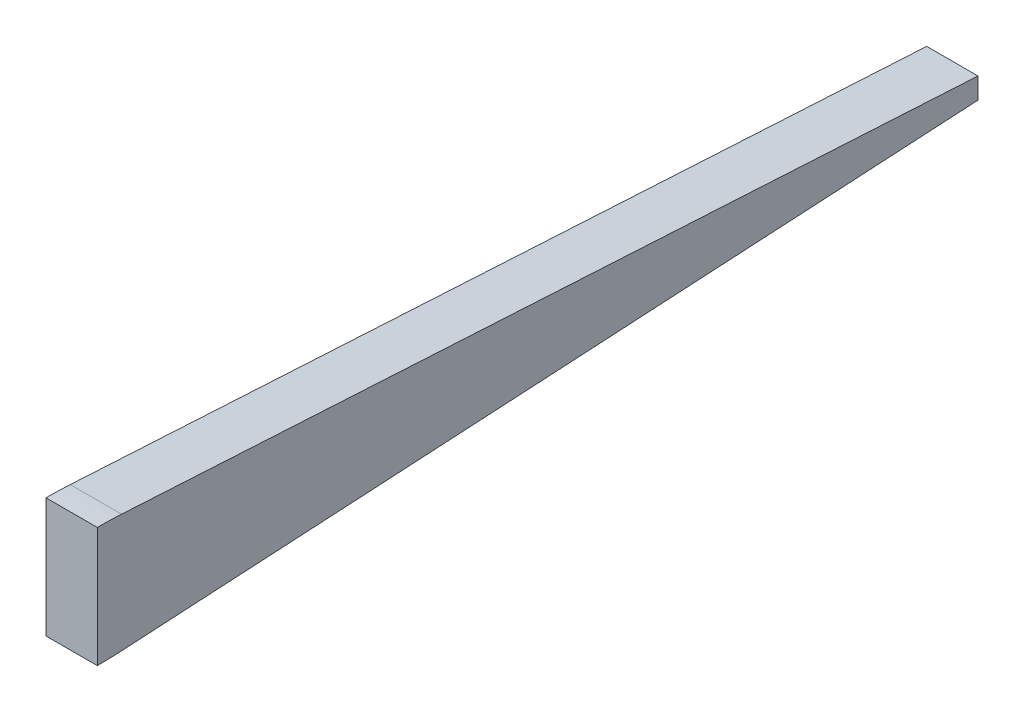
ISO-10303-21;
HEADER;
FILE_DESCRIPTION(('STEP AP214'),'2;1');
FILE_NAME('part.step','',(''),(''),'','','');
FILE_SCHEMA(('AUTOMOTIVE_DESIGN { 1 0 10303 214 1 1 1 1 }'));
ENDSEC;
DATA;
#1=APPLICATION_CONTEXT('core data for automotive mechanical design processes');
#2=APPLICATION_PROTOCOL_DEFINITION('international standard','automotive_design',2000,#1);
#3=PRODUCT_CONTEXT('',#1,'mechanical');
#4=PRODUCT('Part','Part','',(#3));
#5=PRODUCT_RELATED_PRODUCT_CATEGORY('part','',(#4));
#6=PRODUCT_DEFINITION_FORMATION('','',#4);
#7=PRODUCT_DEFINITION_CONTEXT('part definition',#1,'design');
#8=PRODUCT_DEFINITION('design','',#6,#7);
#9=PRODUCT_DEFINITION_SHAPE('','',#8);
#10=(LENGTH_UNIT() NAMED_UNIT(*) SI_UNIT(.MILLI.,.METRE.));
#11=(NAMED_UNIT(*) PLANE_ANGLE_UNIT() SI_UNIT($,.RADIAN.));
#12=(NAMED_UNIT(*) SI_UNIT($,.STERADIAN.) SOLID_ANGLE_UNIT());
#13=UNCERTAINTY_MEASURE_WITH_UNIT(LENGTH_MEASURE(1.E-05),#10,'distance_accuracy_value','');
#14=(GEOMETRIC_REPRESENTATION_CONTEXT(3) GLOBAL_UNCERTAINTY_ASSIGNED_CONTEXT((#13)) GLOBAL_UNIT_ASSIGNED_CONTEXT((#10,
#11,#12)) REPRESENTATION_CONTEXT('',''));
#15=CARTESIAN_POINT('',(0.,0.,0.));
#16=DIRECTION('',(0.,0.,1.));
#17=DIRECTION('',(1.,0.,0.));
#18=AXIS2_PLACEMENT_3D('',#15,#16,#17);
#19=CARTESIAN_POINT('',(6.,2.44733199926668,-306.));
#20=DIRECTION('',(0.,0.,1.));
#21=DIRECTION('',(1.,0.,0.));
#22=AXIS2_PLACEMENT_3D('',#19,#20,#21);
#23=PLANE('',#22);
#24=DIRECTION('',(0.,1.,0.));
#25=VECTOR('',#24,1.);
#26=CARTESIAN_POINT('',(-6.,2.44733199926668,-306.));
#27=LINE('',#26,#25);
#28=CARTESIAN_POINT('',(-6.,-2.44733199926668,-306.));
#29=VERTEX_POINT('',#28);
#30=CARTESIAN_POINT('',(-6.,2.44733199926668,-306.));
#31=VERTEX_POINT('',#30);
#32=EDGE_CURVE('E102',#29,#31,#27,.T.);
#33=ORIENTED_EDGE('',*,*,#32,.T.);
#34=DIRECTION('',(-1.,0.,0.));
#35=VECTOR('',#34,1.);
#36=CARTESIAN_POINT('',(6.,2.44733199926668,-306.));
#37=LINE('',#36,#35);
#38=CARTESIAN_POINT('',(6.,2.44733199926668,-306.));
#39=VERTEX_POINT('',#38);
#40=EDGE_CURVE('E11',#39,#31,#37,.T.);
#41=ORIENTED_EDGE('',*,*,#40,.F.);
#42=DIRECTION('',(0.,1.,0.));
#43=VECTOR('',#42,1.);
#44=CARTESIAN_POINT('',(6.,2.44733199926668,-306.));
#45=LINE('',#44,#43);
#46=CARTESIAN_POINT('',(6.,-2.44733199926668,-306.));
#47=VERTEX_POINT('',#46);
#48=EDGE_CURVE('E93',#47,#39,#45,.T.);
#49=ORIENTED_EDGE('',*,*,#48,.F.);
#50=DIRECTION('',(-1.,0.,0.));
#51=VECTOR('',#50,1.);
#52=CARTESIAN_POINT('',(6.,-2.44733199926668,-306.));
#53=LINE('',#52,#51);
#54=EDGE_CURVE('E116',#47,#29,#53,.T.);
#55=ORIENTED_EDGE('',*,*,#54,.T.);
#56=EDGE_LOOP('',(#33,#41,#49,#55));
#57=FACE_BOUND('',#56,.T.);
#58=ADVANCED_FACE('F31',(#57),#23,.F.);
#59=CARTESIAN_POINT('',(6.,13.8387088313527,-105.677342590365));
#60=DIRECTION('',(0.,-0.998387088313527,0.0567734259036518));
#61=DIRECTION('',(0.,-0.0567734259036518,-0.998387088313527));
#62=AXIS2_PLACEMENT_3D('',#59,#60,#61);
#63=PLANE('',#62);
#64=DIRECTION('',(0.,0.0567734259036518,0.998387088313527));
#65=VECTOR('',#64,1.);
#66=CARTESIAN_POINT('',(-6.,13.8387088313527,-105.677342590365));
#67=LINE('',#66,#65);
#68=CARTESIAN_POINT('',(-6.,13.8387088313527,-105.677342590365));
#69=VERTEX_POINT('',#68);
#70=EDGE_CURVE('E122',#31,#69,#67,.T.);
#71=ORIENTED_EDGE('',*,*,#70,.T.);
#72=DIRECTION('',(-1.,0.,0.));
#73=VECTOR('',#72,1.);
#74=CARTESIAN_POINT('',(6.,13.8387088313527,-105.677342590365));
#75=LINE('',#74,#73);
#76=CARTESIAN_POINT('',(6.,13.8387088313527,-105.677342590365));
#77=VERTEX_POINT('',#76);
#78=EDGE_CURVE('E38',#77,#69,#75,.T.);
#79=ORIENTED_EDGE('',*,*,#78,.F.);
#80=DIRECTION('',(0.,0.0567734259036518,0.998387088313527));
#81=VECTOR('',#80,1.);
#82=CARTESIAN_POINT('',(6.,2.66612990370668,-302.152337131924));
#83=LINE('',#82,#81);
#84=EDGE_CURVE('E50',#39,#77,#83,.T.);
#85=ORIENTED_EDGE('',*,*,#84,.F.);
#86=ORIENTED_EDGE('',*,*,#40,.T.);
#87=EDGE_LOOP('',(#71,#79,#85,#86));
#88=FACE_BOUND('',#87,.T.);
#89=ADVANCED_FACE('F135',(#88),#63,.F.);
#90=CARTESIAN_POINT('',(6.,-86.,-100.));
#91=DIRECTION('',(-1.,0.,0.));
#92=DIRECTION('',(0.,0.,1.));
#93=AXIS2_PLACEMENT_3D('',#90,#91,#92);
#94=CYLINDRICAL_SURFACE('',#93,100.);
#95=CARTESIAN_POINT('',(-6.,-86.,-100.));
#96=DIRECTION('',(1.,0.,0.));
#97=DIRECTION('',(0.,0.,1.));
#98=AXIS2_PLACEMENT_3D('',#95,#96,#97);
#99=CIRCLE('',#98,100.);
#100=CARTESIAN_POINT('',(-6.,14.,-100.));
#101=VERTEX_POINT('',#100);
#102=EDGE_CURVE('E94',#69,#101,#99,.T.);
#103=ORIENTED_EDGE('',*,*,#102,.T.);
#104=DIRECTION('',(-1.,0.,0.));
#105=VECTOR('',#104,1.);
#106=CARTESIAN_POINT('',(6.,14.,-100.));
#107=LINE('',#106,#105);
#108=CARTESIAN_POINT('',(6.,14.,-100.));
#109=VERTEX_POINT('',#108);
#110=EDGE_CURVE('E89',#109,#101,#107,.T.);
#111=ORIENTED_EDGE('',*,*,#110,.F.);
#112=CARTESIAN_POINT('',(6.,-86.,-100.));
#113=DIRECTION('',(1.,0.,0.));
#114=DIRECTION('',(0.,0.,1.));
#115=AXIS2_PLACEMENT_3D('',#112,#113,#114);
#116=CIRCLE('',#115,100.);
#117=EDGE_CURVE('E45',#77,#109,#116,.T.);
#118=ORIENTED_EDGE('',*,*,#117,.F.);
#119=ORIENTED_EDGE('',*,*,#78,.T.);
#120=EDGE_LOOP('',(#103,#111,#118,#119));
#121=FACE_BOUND('',#120,.T.);
#122=ADVANCED_FACE('F132',(#121),#94,.T.);
#123=CARTESIAN_POINT('',(6.,14.,-100.));
#124=DIRECTION('',(0.,0.,-1.));
#125=DIRECTION('',(0.,1.,0.));
#126=AXIS2_PLACEMENT_3D('',#123,#124,#125);
#127=PLANE('',#126);
#128=DIRECTION('',(0.,-1.,0.));
#129=VECTOR('',#128,1.);
#130=CARTESIAN_POINT('',(-6.,14.,-100.));
#131=LINE('',#130,#129);
#132=CARTESIAN_POINT('',(-6.,-14.,-100.));
#133=VERTEX_POINT('',#132);
#134=EDGE_CURVE('E83',#101,#133,#131,.T.);
#135=ORIENTED_EDGE('',*,*,#134,.T.);
#136=DIRECTION('',(-1.,0.,0.));
#137=VECTOR('',#136,1.);
#138=CARTESIAN_POINT('',(6.,-14.,-100.));
#139=LINE('',#138,#137);
#140=CARTESIAN_POINT('',(6.,-14.,-100.));
#141=VERTEX_POINT('',#140);
#142=EDGE_CURVE('E87',#141,#133,#139,.T.);
#143=ORIENTED_EDGE('',*,*,#142,.F.);
#144=DIRECTION('',(0.,-1.,0.));
#145=VECTOR('',#144,1.);
#146=CARTESIAN_POINT('',(6.,14.,-100.));
#147=LINE('',#146,#145);
#148=EDGE_CURVE('E128',#109,#141,#147,.T.);
#149=ORIENTED_EDGE('',*,*,#148,.F.);
#150=ORIENTED_EDGE('',*,*,#110,.T.);
#151=EDGE_LOOP('',(#135,#143,#149,#150));
#152=FACE_BOUND('',#151,.T.);
#153=ADVANCED_FACE('F85',(#152),#127,.F.);
#154=CARTESIAN_POINT('',(6.,-86.,-100.));
#155=DIRECTION('',(-1.,0.,0.));
#156=DIRECTION('',(0.,0.,1.));
#157=AXIS2_PLACEMENT_3D('',#154,#155,#156);
#158=PLANE('',#157);
#159=ORIENTED_EDGE('',*,*,#48,.T.);
#160=ORIENTED_EDGE('',*,*,#84,.T.);
#161=ORIENTED_EDGE('',*,*,#117,.T.);
#162=ORIENTED_EDGE('',*,*,#148,.T.);
#163=CARTESIAN_POINT('',(6.,86.,-100.));
#164=DIRECTION('',(-1.,0.,0.));
#165=DIRECTION('',(0.,0.,1.));
#166=AXIS2_PLACEMENT_3D('',#163,#164,#165);
#167=CIRCLE('',#166,100.);
#168=CARTESIAN_POINT('',(6.,-13.8387088313527,-105.677342590365));
#169=VERTEX_POINT('',#168);
#170=EDGE_CURVE('E101',#169,#141,#167,.T.);
#171=ORIENTED_EDGE('',*,*,#170,.F.);
#172=DIRECTION('',(0.,-0.0567734259036518,0.998387088313527));
#173=VECTOR('',#172,1.);
#174=CARTESIAN_POINT('',(6.,-13.8387088313527,-105.677342590365));
#175=LINE('',#174,#173);
#176=EDGE_CURVE('E113',#47,#169,#175,.T.);
#177=ORIENTED_EDGE('',*,*,#176,.F.);
#178=EDGE_LOOP('',(#159,#160,#161,#162,#171,#177));
#179=FACE_BOUND('',#178,.T.);
#180=ADVANCED_FACE('F141',(#179),#158,.F.);
#181=CARTESIAN_POINT('',(-6.,-86.,-100.));
#182=DIRECTION('',(-1.,0.,0.));
#183=DIRECTION('',(0.,0.,1.));
#184=AXIS2_PLACEMENT_3D('',#181,#182,#183);
#185=PLANE('',#184);
#186=ORIENTED_EDGE('',*,*,#32,.F.);
#187=DIRECTION('',(0.,-0.0567734259036518,0.998387088313527));
#188=VECTOR('',#187,1.);
#189=CARTESIAN_POINT('',(-6.,-2.66612990370668,-302.152337131924));
#190=LINE('',#189,#188);
#191=CARTESIAN_POINT('',(-6.,-13.8387088313527,-105.677342590365));
#192=VERTEX_POINT('',#191);
#193=EDGE_CURVE('E107',#29,#192,#190,.T.);
#194=ORIENTED_EDGE('',*,*,#193,.T.);
#195=CARTESIAN_POINT('',(-6.,86.,-100.));
#196=DIRECTION('',(-1.,0.,0.));
#197=DIRECTION('',(0.,0.,1.));
#198=AXIS2_PLACEMENT_3D('',#195,#196,#197);
#199=CIRCLE('',#198,100.);
#200=EDGE_CURVE('E99',#192,#133,#199,.T.);
#201=ORIENTED_EDGE('',*,*,#200,.T.);
#202=ORIENTED_EDGE('',*,*,#134,.F.);
#203=ORIENTED_EDGE('',*,*,#102,.F.);
#204=ORIENTED_EDGE('',*,*,#70,.F.);
#205=EDGE_LOOP('',(#186,#194,#201,#202,#203,#204));
#206=FACE_BOUND('',#205,.T.);
#207=ADVANCED_FACE('F105',(#206),#185,.T.);
#208=CARTESIAN_POINT('',(6.,86.,-100.));
#209=DIRECTION('',(-1.,0.,0.));
#210=DIRECTION('',(0.,0.,1.));
#211=AXIS2_PLACEMENT_3D('',#208,#209,#210);
#212=CYLINDRICAL_SURFACE('',#211,100.);
#213=ORIENTED_EDGE('',*,*,#200,.F.);
#214=DIRECTION('',(-1.,0.,0.));
#215=VECTOR('',#214,1.);
#216=CARTESIAN_POINT('',(6.,-13.8387088313527,-105.677342590365));
#217=LINE('',#216,#215);
#218=EDGE_CURVE('E103',#169,#192,#217,.T.);
#219=ORIENTED_EDGE('',*,*,#218,.F.);
#220=ORIENTED_EDGE('',*,*,#170,.T.);
#221=ORIENTED_EDGE('',*,*,#142,.T.);
#222=EDGE_LOOP('',(#213,#219,#220,#221));
#223=FACE_BOUND('',#222,.T.);
#224=ADVANCED_FACE('F98',(#223),#212,.T.);
#225=CARTESIAN_POINT('',(6.,-2.66612990370668,-302.152337131924));
#226=DIRECTION('',(0.,-0.998387088313527,-0.0567734259036518));
#227=DIRECTION('',(0.,0.0567734259036518,-0.998387088313527));
#228=AXIS2_PLACEMENT_3D('',#225,#226,#227);
#229=PLANE('',#228);
#230=ORIENTED_EDGE('',*,*,#193,.F.);
#231=ORIENTED_EDGE('',*,*,#54,.F.);
#232=ORIENTED_EDGE('',*,*,#176,.T.);
#233=ORIENTED_EDGE('',*,*,#218,.T.);
#234=EDGE_LOOP('',(#230,#231,#232,#233));
#235=FACE_BOUND('',#234,.T.);
#236=ADVANCED_FACE('F140',(#235),#229,.T.);
#237=CLOSED_SHELL('',(#58,#89,#122,#153,#180,#207,#224,#236));
#238=MANIFOLD_SOLID_BREP('B2',#237);
#239=ADVANCED_BREP_SHAPE_REPRESENTATION('',(#18,#238),#14);
#240=SHAPE_DEFINITION_REPRESENTATION(#9,#239);
ENDSEC;
END-ISO-10303-21;
